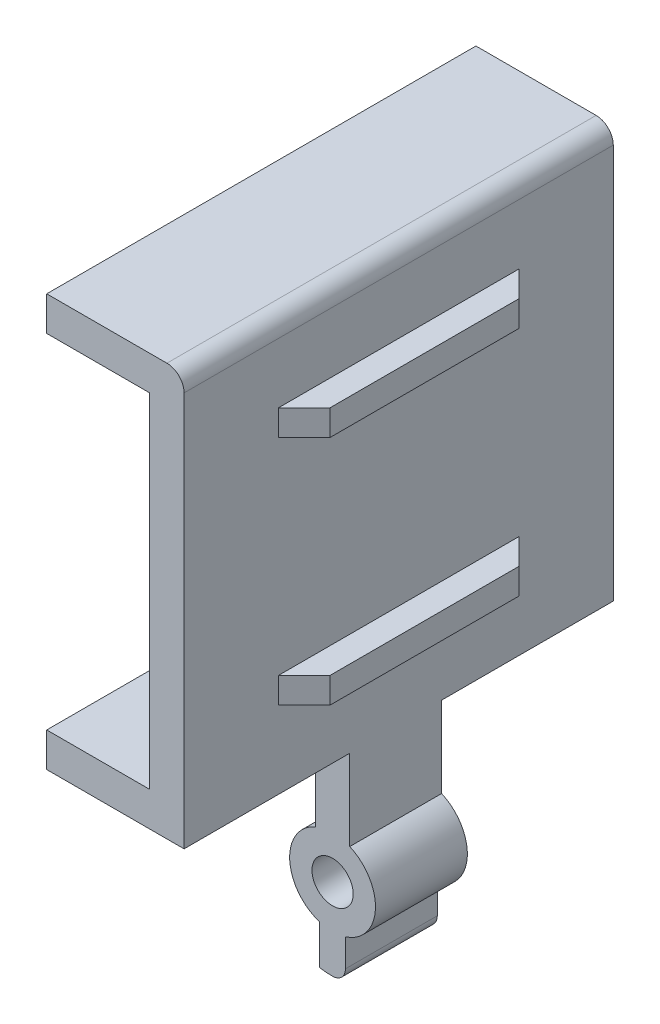
ISO-10303-21;
HEADER;
FILE_DESCRIPTION(('STEP AP214'),'2;1');
FILE_NAME('part.step','',(''),(''),'','','');
FILE_SCHEMA(('AUTOMOTIVE_DESIGN { 1 0 10303 214 1 1 1 1 }'));
ENDSEC;
DATA;
#1=APPLICATION_CONTEXT('core data for automotive mechanical design processes');
#2=APPLICATION_PROTOCOL_DEFINITION('international standard','automotive_design',2000,#1);
#3=PRODUCT_CONTEXT('',#1,'mechanical');
#4=PRODUCT('Part','Part','',(#3));
#5=PRODUCT_RELATED_PRODUCT_CATEGORY('part','',(#4));
#6=PRODUCT_DEFINITION_FORMATION('','',#4);
#7=PRODUCT_DEFINITION_CONTEXT('part definition',#1,'design');
#8=PRODUCT_DEFINITION('design','',#6,#7);
#9=PRODUCT_DEFINITION_SHAPE('','',#8);
#10=(LENGTH_UNIT() NAMED_UNIT(*) SI_UNIT(.MILLI.,.METRE.));
#11=(NAMED_UNIT(*) PLANE_ANGLE_UNIT() SI_UNIT($,.RADIAN.));
#12=(NAMED_UNIT(*) SI_UNIT($,.STERADIAN.) SOLID_ANGLE_UNIT());
#13=UNCERTAINTY_MEASURE_WITH_UNIT(LENGTH_MEASURE(1.E-05),#10,'distance_accuracy_value','');
#14=(GEOMETRIC_REPRESENTATION_CONTEXT(3) GLOBAL_UNCERTAINTY_ASSIGNED_CONTEXT((#13)) GLOBAL_UNIT_ASSIGNED_CONTEXT((#10,
#11,#12)) REPRESENTATION_CONTEXT('',''));
#15=CARTESIAN_POINT('',(0.,0.,0.));
#16=DIRECTION('',(0.,0.,1.));
#17=DIRECTION('',(1.,0.,0.));
#18=AXIS2_PLACEMENT_3D('',#15,#16,#17);
#19=CARTESIAN_POINT('',(2.5,11.5,-5.));
#20=DIRECTION('',(-1.,0.,0.));
#21=DIRECTION('',(0.,-1.,0.));
#22=AXIS2_PLACEMENT_3D('',#19,#20,#21);
#23=PLANE('',#22);
#24=DIRECTION('',(0.,0.,1.));
#25=VECTOR('',#24,1.);
#26=CARTESIAN_POINT('',(2.5,26.5,-5.));
#27=LINE('',#26,#25);
#28=CARTESIAN_POINT('',(2.5,26.5,-2.99999999999999));
#29=VERTEX_POINT('',#28);
#30=CARTESIAN_POINT('',(2.5,26.5,7.99999999999997));
#31=VERTEX_POINT('',#30);
#32=EDGE_CURVE('E297',#29,#31,#27,.T.);
#33=ORIENTED_EDGE('',*,*,#32,.T.);
#34=DIRECTION('',(0.,-1.,0.));
#35=VECTOR('',#34,1.);
#36=CARTESIAN_POINT('',(2.5,11.5,7.99999999999997));
#37=LINE('',#36,#35);
#38=CARTESIAN_POINT('',(2.5,25.,7.99999999999997));
#39=VERTEX_POINT('',#38);
#40=EDGE_CURVE('E386',#31,#39,#37,.T.);
#41=ORIENTED_EDGE('',*,*,#40,.T.);
#42=DIRECTION('',(0.,0.,-1.));
#43=VECTOR('',#42,1.);
#44=CARTESIAN_POINT('',(2.5,25.,10.));
#45=LINE('',#44,#43);
#46=CARTESIAN_POINT('',(2.5,25.,-2.99999999999999));
#47=VERTEX_POINT('',#46);
#48=EDGE_CURVE('E285',#39,#47,#45,.T.);
#49=ORIENTED_EDGE('',*,*,#48,.T.);
#50=DIRECTION('',(0.,1.,0.));
#51=VECTOR('',#50,1.);
#52=CARTESIAN_POINT('',(2.5,26.5,-2.99999999999999));
#53=LINE('',#52,#51);
#54=EDGE_CURVE('E383',#47,#29,#53,.T.);
#55=ORIENTED_EDGE('',*,*,#54,.T.);
#56=EDGE_LOOP('',(#33,#41,#49,#55));
#57=FACE_BOUND('',#56,.T.);
#58=ADVANCED_FACE('F36',(#57),#23,.F.);
#59=CARTESIAN_POINT('',(0.999999999999998,2.29128784747792,5.35));
#60=DIRECTION('',(-1.,0.,0.));
#61=DIRECTION('',(0.,-1.,0.));
#62=AXIS2_PLACEMENT_3D('',#59,#60,#61);
#63=PLANE('',#62);
#64=DIRECTION('',(0.,1.,0.));
#65=VECTOR('',#64,1.);
#66=CARTESIAN_POINT('',(0.999999999999998,2.29128784747792,0.));
#67=LINE('',#66,#65);
#68=CARTESIAN_POINT('',(0.999999999999998,2.29128784747792,0.));
#69=VERTEX_POINT('',#68);
#70=CARTESIAN_POINT('',(0.999999999999999,7.,0.));
#71=VERTEX_POINT('',#70);
#72=EDGE_CURVE('E214',#69,#71,#67,.T.);
#73=ORIENTED_EDGE('',*,*,#72,.T.);
#74=DIRECTION('',(0.,0.,-1.));
#75=VECTOR('',#74,1.);
#76=CARTESIAN_POINT('',(0.999999999999998,7.,15.));
#77=LINE('',#76,#75);
#78=CARTESIAN_POINT('',(0.999999999999998,7.,-10.));
#79=VERTEX_POINT('',#78);
#80=EDGE_CURVE('E206',#71,#79,#77,.T.);
#81=ORIENTED_EDGE('',*,*,#80,.T.);
#82=DIRECTION('',(0.,-1.,0.));
#83=VECTOR('',#82,1.);
#84=CARTESIAN_POINT('',(0.999999999999998,7.,-10.));
#85=LINE('',#84,#83);
#86=CARTESIAN_POINT('',(1.,30.,-10.));
#87=VERTEX_POINT('',#86);
#88=EDGE_CURVE('E211',#87,#79,#85,.T.);
#89=ORIENTED_EDGE('',*,*,#88,.F.);
#90=DIRECTION('',(0.,0.,-1.));
#91=VECTOR('',#90,1.);
#92=CARTESIAN_POINT('',(1.,30.,5.35));
#93=LINE('',#92,#91);
#94=CARTESIAN_POINT('',(1.,30.,15.));
#95=VERTEX_POINT('',#94);
#96=EDGE_CURVE('E358',#95,#87,#93,.T.);
#97=ORIENTED_EDGE('',*,*,#96,.F.);
#98=DIRECTION('',(0.,-1.,0.));
#99=VECTOR('',#98,1.);
#100=CARTESIAN_POINT('',(0.999999999999998,7.,15.));
#101=LINE('',#100,#99);
#102=CARTESIAN_POINT('',(0.999999999999998,7.,15.));
#103=VERTEX_POINT('',#102);
#104=EDGE_CURVE('E253',#95,#103,#101,.T.);
#105=ORIENTED_EDGE('',*,*,#104,.T.);
#106=CARTESIAN_POINT('',(0.999999999999999,7.,5.35));
#107=VERTEX_POINT('',#106);
#108=EDGE_CURVE('E217',#103,#107,#77,.T.);
#109=ORIENTED_EDGE('',*,*,#108,.T.);
#110=DIRECTION('',(0.,1.,0.));
#111=VECTOR('',#110,1.);
#112=CARTESIAN_POINT('',(0.999999999999998,2.29128784747792,5.35));
#113=LINE('',#112,#111);
#114=CARTESIAN_POINT('',(0.999999999999998,2.29128784747792,5.35));
#115=VERTEX_POINT('',#114);
#116=EDGE_CURVE('E337',#115,#107,#113,.T.);
#117=ORIENTED_EDGE('',*,*,#116,.F.);
#118=DIRECTION('',(0.,0.,-1.));
#119=VECTOR('',#118,1.);
#120=CARTESIAN_POINT('',(0.999999999999998,2.29128784747792,5.35));
#121=LINE('',#120,#119);
#122=EDGE_CURVE('E360',#115,#69,#121,.T.);
#123=ORIENTED_EDGE('',*,*,#122,.T.);
#124=EDGE_LOOP('',(#73,#81,#89,#97,#105,#109,#117,#123));
#125=FACE_BOUND('',#124,.T.);
#126=DIRECTION('',(0.,0.,-1.));
#127=VECTOR('',#126,1.);
#128=CARTESIAN_POINT('',(0.999999999999999,11.5,5.35));
#129=LINE('',#128,#127);
#130=CARTESIAN_POINT('',(0.999999999999999,11.5,9.49999999999998));
#131=VERTEX_POINT('',#130);
#132=CARTESIAN_POINT('',(0.999999999999999,11.5,-4.49999999999997));
#133=VERTEX_POINT('',#132);
#134=EDGE_CURVE('E377',#131,#133,#129,.T.);
#135=ORIENTED_EDGE('',*,*,#134,.F.);
#136=DIRECTION('',(0.,-1.,0.));
#137=VECTOR('',#136,1.);
#138=CARTESIAN_POINT('',(0.999999999999998,2.29128784747792,9.49999999999998));
#139=LINE('',#138,#137);
#140=CARTESIAN_POINT('',(0.999999999999999,13.,9.49999999999998));
#141=VERTEX_POINT('',#140);
#142=EDGE_CURVE('E413',#131,#141,#139,.F.);
#143=ORIENTED_EDGE('',*,*,#142,.T.);
#144=DIRECTION('',(0.,0.,-1.));
#145=VECTOR('',#144,1.);
#146=CARTESIAN_POINT('',(0.999999999999999,13.,10.));
#147=LINE('',#146,#145);
#148=CARTESIAN_POINT('',(0.999999999999999,13.,-4.49999999999997));
#149=VERTEX_POINT('',#148);
#150=EDGE_CURVE('E292',#141,#149,#147,.T.);
#151=ORIENTED_EDGE('',*,*,#150,.T.);
#152=DIRECTION('',(0.,-1.,0.));
#153=VECTOR('',#152,1.);
#154=CARTESIAN_POINT('',(0.999999999999998,2.29128784747792,-4.49999999999997));
#155=LINE('',#154,#153);
#156=EDGE_CURVE('E46',#149,#133,#155,.T.);
#157=ORIENTED_EDGE('',*,*,#156,.T.);
#158=EDGE_LOOP('',(#135,#143,#151,#157));
#159=FACE_BOUND('',#158,.T.);
#160=DIRECTION('',(0.,0.,1.));
#161=VECTOR('',#160,1.);
#162=CARTESIAN_POINT('',(1.,26.5,5.35));
#163=LINE('',#162,#161);
#164=CARTESIAN_POINT('',(1.,26.5,-4.49999999999997));
#165=VERTEX_POINT('',#164);
#166=CARTESIAN_POINT('',(1.,26.5,9.49999999999998));
#167=VERTEX_POINT('',#166);
#168=EDGE_CURVE('E380',#165,#167,#163,.T.);
#169=ORIENTED_EDGE('',*,*,#168,.F.);
#170=DIRECTION('',(0.,-1.,0.));
#171=VECTOR('',#170,1.);
#172=CARTESIAN_POINT('',(0.999999999999998,2.29128784747792,-4.49999999999997));
#173=LINE('',#172,#171);
#174=CARTESIAN_POINT('',(1.,25.,-4.49999999999997));
#175=VERTEX_POINT('',#174);
#176=EDGE_CURVE('E11',#165,#175,#173,.T.);
#177=ORIENTED_EDGE('',*,*,#176,.T.);
#178=DIRECTION('',(0.,0.,-1.));
#179=VECTOR('',#178,1.);
#180=CARTESIAN_POINT('',(1.,25.,10.));
#181=LINE('',#180,#179);
#182=CARTESIAN_POINT('',(1.,25.,9.49999999999998));
#183=VERTEX_POINT('',#182);
#184=EDGE_CURVE('E289',#183,#175,#181,.T.);
#185=ORIENTED_EDGE('',*,*,#184,.F.);
#186=DIRECTION('',(0.,-1.,0.));
#187=VECTOR('',#186,1.);
#188=CARTESIAN_POINT('',(0.999999999999998,2.29128784747792,9.49999999999998));
#189=LINE('',#188,#187);
#190=EDGE_CURVE('E411',#183,#167,#189,.F.);
#191=ORIENTED_EDGE('',*,*,#190,.T.);
#192=EDGE_LOOP('',(#169,#177,#185,#191));
#193=FACE_BOUND('',#192,.T.);
#194=ADVANCED_FACE('F208',(#125,#159,#193),#63,.F.);
#195=CARTESIAN_POINT('',(-1.,2.29128784747792,5.35));
#196=DIRECTION('',(1.,0.,0.));
#197=DIRECTION('',(0.,1.,0.));
#198=AXIS2_PLACEMENT_3D('',#195,#196,#197);
#199=PLANE('',#198);
#200=DIRECTION('',(0.,0.,-1.));
#201=VECTOR('',#200,1.);
#202=CARTESIAN_POINT('',(-1.,9.,5.35));
#203=LINE('',#202,#201);
#204=CARTESIAN_POINT('',(-1.,9.,15.));
#205=VERTEX_POINT('',#204);
#206=CARTESIAN_POINT('',(-1.,9.,-10.));
#207=VERTEX_POINT('',#206);
#208=EDGE_CURVE('E306',#205,#207,#203,.T.);
#209=ORIENTED_EDGE('',*,*,#208,.F.);
#210=DIRECTION('',(0.,1.,0.));
#211=VECTOR('',#210,1.);
#212=CARTESIAN_POINT('',(-1.,29.,15.));
#213=LINE('',#212,#211);
#214=CARTESIAN_POINT('',(-1.,29.,15.));
#215=VERTEX_POINT('',#214);
#216=EDGE_CURVE('E264',#205,#215,#213,.T.);
#217=ORIENTED_EDGE('',*,*,#216,.T.);
#218=DIRECTION('',(0.,0.,-1.));
#219=VECTOR('',#218,1.);
#220=CARTESIAN_POINT('',(-1.,29.,12.6301098892805));
#221=LINE('',#220,#219);
#222=CARTESIAN_POINT('',(-1.,29.,-10.));
#223=VERTEX_POINT('',#222);
#224=EDGE_CURVE('E308',#215,#223,#221,.T.);
#225=ORIENTED_EDGE('',*,*,#224,.T.);
#226=DIRECTION('',(0.,1.,0.));
#227=VECTOR('',#226,1.);
#228=CARTESIAN_POINT('',(-1.,29.,-10.));
#229=LINE('',#228,#227);
#230=EDGE_CURVE('E241',#207,#223,#229,.T.);
#231=ORIENTED_EDGE('',*,*,#230,.F.);
#232=EDGE_LOOP('',(#209,#217,#225,#231));
#233=FACE_BOUND('',#232,.T.);
#234=ADVANCED_FACE('F449',(#233),#199,.F.);
#235=CARTESIAN_POINT('',(0.,30.,5.35));
#236=DIRECTION('',(0.,0.,-1.));
#237=DIRECTION('',(-1.,0.,0.));
#238=AXIS2_PLACEMENT_3D('',#235,#236,#237);
#239=CYLINDRICAL_SURFACE('',#238,1.);
#240=DIRECTION('',(0.,0.,-1.));
#241=VECTOR('',#240,1.);
#242=CARTESIAN_POINT('',(0.,31.,12.6301098892805));
#243=LINE('',#242,#241);
#244=CARTESIAN_POINT('',(0.,31.,15.));
#245=VERTEX_POINT('',#244);
#246=CARTESIAN_POINT('',(0.,31.,-10.));
#247=VERTEX_POINT('',#246);
#248=EDGE_CURVE('E309',#245,#247,#243,.T.);
#249=ORIENTED_EDGE('',*,*,#248,.F.);
#250=CARTESIAN_POINT('',(0.,30.,15.));
#251=DIRECTION('',(0.,0.,-1.));
#252=DIRECTION('',(-1.,0.,0.));
#253=AXIS2_PLACEMENT_3D('',#250,#251,#252);
#254=CIRCLE('',#253,1.);
#255=EDGE_CURVE('E218',#245,#95,#254,.T.);
#256=ORIENTED_EDGE('',*,*,#255,.T.);
#257=ORIENTED_EDGE('',*,*,#96,.T.);
#258=CARTESIAN_POINT('',(0.,30.,-10.));
#259=DIRECTION('',(0.,0.,-1.));
#260=DIRECTION('',(-1.,0.,0.));
#261=AXIS2_PLACEMENT_3D('',#258,#259,#260);
#262=CIRCLE('',#261,1.);
#263=EDGE_CURVE('E234',#247,#87,#262,.T.);
#264=ORIENTED_EDGE('',*,*,#263,.F.);
#265=EDGE_LOOP('',(#249,#256,#257,#264));
#266=FACE_BOUND('',#265,.T.);
#267=ADVANCED_FACE('F495',(#266),#239,.T.);
#268=CARTESIAN_POINT('',(0.,0.,5.35));
#269=DIRECTION('',(0.,0.,1.));
#270=DIRECTION('',(1.,0.,0.));
#271=AXIS2_PLACEMENT_3D('',#268,#269,#270);
#272=PLANE('',#271);
#273=DIRECTION('',(1.,0.,0.));
#274=VECTOR('',#273,1.);
#275=CARTESIAN_POINT('',(0.,7.,5.35));
#276=LINE('',#275,#274);
#277=CARTESIAN_POINT('',(-1.,7.,5.35));
#278=VERTEX_POINT('',#277);
#279=EDGE_CURVE('E281',#278,#107,#276,.T.);
#280=ORIENTED_EDGE('',*,*,#279,.F.);
#281=DIRECTION('',(0.,-1.,0.));
#282=VECTOR('',#281,1.);
#283=CARTESIAN_POINT('',(-1.,2.29128784747792,5.35));
#284=LINE('',#283,#282);
#285=CARTESIAN_POINT('',(-1.,2.29128784747792,5.35));
#286=VERTEX_POINT('',#285);
#287=EDGE_CURVE('E339',#278,#286,#284,.T.);
#288=ORIENTED_EDGE('',*,*,#287,.T.);
#289=CARTESIAN_POINT('',(0.,0.,5.35));
#290=DIRECTION('',(0.,0.,1.));
#291=DIRECTION('',(1.,0.,0.));
#292=AXIS2_PLACEMENT_3D('',#289,#290,#291);
#293=CIRCLE('',#292,2.5);
#294=CARTESIAN_POINT('',(-0.750000000000004,-2.38484800354236,5.35));
#295=VERTEX_POINT('',#294);
#296=EDGE_CURVE('E323',#286,#295,#293,.T.);
#297=ORIENTED_EDGE('',*,*,#296,.T.);
#298=DIRECTION('',(0.,-1.,0.));
#299=VECTOR('',#298,1.);
#300=CARTESIAN_POINT('',(-0.750000000000001,-4.69041575982343,5.35));
#301=LINE('',#300,#299);
#302=CARTESIAN_POINT('',(-0.750000000000002,-4.69041575982343,5.35));
#303=VERTEX_POINT('',#302);
#304=EDGE_CURVE('E326',#295,#303,#301,.T.);
#305=ORIENTED_EDGE('',*,*,#304,.T.);
#306=CARTESIAN_POINT('',(0.,0.,5.35));
#307=DIRECTION('',(0.,0.,1.));
#308=DIRECTION('',(1.,0.,0.));
#309=AXIS2_PLACEMENT_3D('',#306,#307,#308);
#310=CIRCLE('',#309,4.75);
#311=CARTESIAN_POINT('',(0.,-4.75,5.35));
#312=VERTEX_POINT('',#311);
#313=EDGE_CURVE('E329',#303,#312,#310,.T.);
#314=ORIENTED_EDGE('',*,*,#313,.T.);
#315=CARTESIAN_POINT('',(0.,-4.,5.35));
#316=DIRECTION('',(0.,0.,1.));
#317=DIRECTION('',(1.,0.,0.));
#318=AXIS2_PLACEMENT_3D('',#315,#316,#317);
#319=CIRCLE('',#318,0.750000000000001);
#320=CARTESIAN_POINT('',(0.750000000000001,-4.,5.35));
#321=VERTEX_POINT('',#320);
#322=EDGE_CURVE('E331',#312,#321,#319,.T.);
#323=ORIENTED_EDGE('',*,*,#322,.T.);
#324=DIRECTION('',(0.,1.,0.));
#325=VECTOR('',#324,1.);
#326=CARTESIAN_POINT('',(0.750000000000001,-4.,5.35));
#327=LINE('',#326,#325);
#328=CARTESIAN_POINT('',(0.749999999999997,-2.38484800354236,5.35));
#329=VERTEX_POINT('',#328);
#330=EDGE_CURVE('E333',#321,#329,#327,.T.);
#331=ORIENTED_EDGE('',*,*,#330,.T.);
#332=CARTESIAN_POINT('',(0.,0.,5.35));
#333=DIRECTION('',(0.,0.,1.));
#334=DIRECTION('',(1.,0.,0.));
#335=AXIS2_PLACEMENT_3D('',#332,#333,#334);
#336=CIRCLE('',#335,2.5);
#337=EDGE_CURVE('E335',#329,#115,#336,.T.);
#338=ORIENTED_EDGE('',*,*,#337,.T.);
#339=ORIENTED_EDGE('',*,*,#116,.T.);
#340=EDGE_LOOP('',(#280,#288,#297,#305,#314,#323,#331,#338,#339));
#341=FACE_BOUND('',#340,.T.);
#342=CARTESIAN_POINT('',(0.,0.,5.35));
#343=DIRECTION('',(0.,0.,1.));
#344=DIRECTION('',(1.,0.,0.));
#345=AXIS2_PLACEMENT_3D('',#342,#343,#344);
#346=CIRCLE('',#345,1.2);
#347=CARTESIAN_POINT('',(1.2,0.,5.35));
#348=VERTEX_POINT('',#347);
#349=EDGE_CURVE('E311',#348,#348,#346,.T.);
#350=ORIENTED_EDGE('',*,*,#349,.F.);
#351=EDGE_LOOP('',(#350));
#352=FACE_BOUND('',#351,.T.);
#353=ADVANCED_FACE('F491',(#341,#352),#272,.T.);
#354=CARTESIAN_POINT('',(0.,0.,0.));
#355=DIRECTION('',(0.,0.,1.));
#356=DIRECTION('',(1.,0.,0.));
#357=AXIS2_PLACEMENT_3D('',#354,#355,#356);
#358=PLANE('',#357);
#359=CARTESIAN_POINT('',(0.,0.,0.));
#360=DIRECTION('',(0.,0.,1.));
#361=DIRECTION('',(1.,0.,0.));
#362=AXIS2_PLACEMENT_3D('',#359,#360,#361);
#363=CIRCLE('',#362,1.2);
#364=CARTESIAN_POINT('',(1.2,0.,0.));
#365=VERTEX_POINT('',#364);
#366=EDGE_CURVE('E317',#365,#365,#363,.T.);
#367=ORIENTED_EDGE('',*,*,#366,.T.);
#368=EDGE_LOOP('',(#367));
#369=FACE_BOUND('',#368,.T.);
#370=DIRECTION('',(0.,-1.,0.));
#371=VECTOR('',#370,1.);
#372=CARTESIAN_POINT('',(-1.,2.29128784747792,0.));
#373=LINE('',#372,#371);
#374=CARTESIAN_POINT('',(-1.,7.,0.));
#375=VERTEX_POINT('',#374);
#376=CARTESIAN_POINT('',(-1.,2.29128784747792,0.));
#377=VERTEX_POINT('',#376);
#378=EDGE_CURVE('E327',#375,#377,#373,.T.);
#379=ORIENTED_EDGE('',*,*,#378,.F.);
#380=DIRECTION('',(1.,0.,0.));
#381=VECTOR('',#380,1.);
#382=CARTESIAN_POINT('',(0.,7.,0.));
#383=LINE('',#382,#381);
#384=EDGE_CURVE('E279',#375,#71,#383,.T.);
#385=ORIENTED_EDGE('',*,*,#384,.T.);
#386=ORIENTED_EDGE('',*,*,#72,.F.);
#387=CARTESIAN_POINT('',(0.,0.,0.));
#388=DIRECTION('',(0.,0.,1.));
#389=DIRECTION('',(1.,0.,0.));
#390=AXIS2_PLACEMENT_3D('',#387,#388,#389);
#391=CIRCLE('',#390,2.5);
#392=CARTESIAN_POINT('',(0.749999999999997,-2.38484800354236,0.));
#393=VERTEX_POINT('',#392);
#394=EDGE_CURVE('E352',#393,#69,#391,.T.);
#395=ORIENTED_EDGE('',*,*,#394,.F.);
#396=DIRECTION('',(0.,1.,0.));
#397=VECTOR('',#396,1.);
#398=CARTESIAN_POINT('',(0.750000000000001,-4.,0.));
#399=LINE('',#398,#397);
#400=CARTESIAN_POINT('',(0.750000000000001,-4.,0.));
#401=VERTEX_POINT('',#400);
#402=EDGE_CURVE('E350',#401,#393,#399,.T.);
#403=ORIENTED_EDGE('',*,*,#402,.F.);
#404=CARTESIAN_POINT('',(0.,-4.,0.));
#405=DIRECTION('',(0.,0.,1.));
#406=DIRECTION('',(1.,0.,0.));
#407=AXIS2_PLACEMENT_3D('',#404,#405,#406);
#408=CIRCLE('',#407,0.750000000000001);
#409=CARTESIAN_POINT('',(0.,-4.75,0.));
#410=VERTEX_POINT('',#409);
#411=EDGE_CURVE('E348',#410,#401,#408,.T.);
#412=ORIENTED_EDGE('',*,*,#411,.F.);
#413=CARTESIAN_POINT('',(0.,0.,0.));
#414=DIRECTION('',(0.,0.,1.));
#415=DIRECTION('',(1.,0.,0.));
#416=AXIS2_PLACEMENT_3D('',#413,#414,#415);
#417=CIRCLE('',#416,4.75);
#418=CARTESIAN_POINT('',(-0.750000000000002,-4.69041575982343,0.));
#419=VERTEX_POINT('',#418);
#420=EDGE_CURVE('E346',#419,#410,#417,.T.);
#421=ORIENTED_EDGE('',*,*,#420,.F.);
#422=DIRECTION('',(0.,-1.,0.));
#423=VECTOR('',#422,1.);
#424=CARTESIAN_POINT('',(-0.750000000000001,-4.69041575982343,0.));
#425=LINE('',#424,#423);
#426=CARTESIAN_POINT('',(-0.750000000000004,-2.38484800354236,0.));
#427=VERTEX_POINT('',#426);
#428=EDGE_CURVE('E344',#427,#419,#425,.T.);
#429=ORIENTED_EDGE('',*,*,#428,.F.);
#430=CARTESIAN_POINT('',(0.,0.,0.));
#431=DIRECTION('',(0.,0.,1.));
#432=DIRECTION('',(1.,0.,0.));
#433=AXIS2_PLACEMENT_3D('',#430,#431,#432);
#434=CIRCLE('',#433,2.5);
#435=EDGE_CURVE('E320',#377,#427,#434,.T.);
#436=ORIENTED_EDGE('',*,*,#435,.F.);
#437=EDGE_LOOP('',(#379,#385,#386,#395,#403,#412,#421,#429,#436));
#438=FACE_BOUND('',#437,.T.);
#439=ADVANCED_FACE('F494',(#369,#438),#358,.F.);
#440=CARTESIAN_POINT('',(0.,0.,5.35));
#441=DIRECTION('',(0.,0.,-1.));
#442=DIRECTION('',(-1.,0.,0.));
#443=AXIS2_PLACEMENT_3D('',#440,#441,#442);
#444=CYLINDRICAL_SURFACE('',#443,2.5);
#445=ORIENTED_EDGE('',*,*,#435,.T.);
#446=DIRECTION('',(0.,0.,-1.));
#447=VECTOR('',#446,1.);
#448=CARTESIAN_POINT('',(-0.750000000000004,-2.38484800354236,5.35));
#449=LINE('',#448,#447);
#450=EDGE_CURVE('E374',#295,#427,#449,.T.);
#451=ORIENTED_EDGE('',*,*,#450,.F.);
#452=ORIENTED_EDGE('',*,*,#296,.F.);
#453=DIRECTION('',(0.,0.,-1.));
#454=VECTOR('',#453,1.);
#455=CARTESIAN_POINT('',(-1.,2.29128784747792,5.35));
#456=LINE('',#455,#454);
#457=EDGE_CURVE('E341',#286,#377,#456,.T.);
#458=ORIENTED_EDGE('',*,*,#457,.T.);
#459=EDGE_LOOP('',(#445,#451,#452,#458));
#460=FACE_BOUND('',#459,.T.);
#461=ADVANCED_FACE('F499',(#460),#444,.T.);
#462=CARTESIAN_POINT('',(-0.750000000000001,-4.69041575982343,5.35));
#463=DIRECTION('',(1.,0.,0.));
#464=DIRECTION('',(0.,1.,0.));
#465=AXIS2_PLACEMENT_3D('',#462,#463,#464);
#466=PLANE('',#465);
#467=ORIENTED_EDGE('',*,*,#428,.T.);
#468=DIRECTION('',(0.,0.,-1.));
#469=VECTOR('',#468,1.);
#470=CARTESIAN_POINT('',(-0.750000000000002,-4.69041575982343,5.35));
#471=LINE('',#470,#469);
#472=EDGE_CURVE('E371',#303,#419,#471,.T.);
#473=ORIENTED_EDGE('',*,*,#472,.F.);
#474=ORIENTED_EDGE('',*,*,#304,.F.);
#475=ORIENTED_EDGE('',*,*,#450,.T.);
#476=EDGE_LOOP('',(#467,#473,#474,#475));
#477=FACE_BOUND('',#476,.T.);
#478=ADVANCED_FACE('F522',(#477),#466,.F.);
#479=CARTESIAN_POINT('',(0.,0.,5.35));
#480=DIRECTION('',(0.,0.,-1.));
#481=DIRECTION('',(-1.,0.,0.));
#482=AXIS2_PLACEMENT_3D('',#479,#480,#481);
#483=CYLINDRICAL_SURFACE('',#482,4.75);
#484=ORIENTED_EDGE('',*,*,#420,.T.);
#485=DIRECTION('',(0.,0.,-1.));
#486=VECTOR('',#485,1.);
#487=CARTESIAN_POINT('',(0.,-4.75,5.35));
#488=LINE('',#487,#486);
#489=EDGE_CURVE('E368',#312,#410,#488,.T.);
#490=ORIENTED_EDGE('',*,*,#489,.F.);
#491=ORIENTED_EDGE('',*,*,#313,.F.);
#492=ORIENTED_EDGE('',*,*,#472,.T.);
#493=EDGE_LOOP('',(#484,#490,#491,#492));
#494=FACE_BOUND('',#493,.T.);
#495=ADVANCED_FACE('F518',(#494),#483,.T.);
#496=CARTESIAN_POINT('',(0.,-4.,5.35));
#497=DIRECTION('',(0.,0.,-1.));
#498=DIRECTION('',(-1.,0.,0.));
#499=AXIS2_PLACEMENT_3D('',#496,#497,#498);
#500=CYLINDRICAL_SURFACE('',#499,0.750000000000001);
#501=ORIENTED_EDGE('',*,*,#411,.T.);
#502=DIRECTION('',(0.,0.,-1.));
#503=VECTOR('',#502,1.);
#504=CARTESIAN_POINT('',(0.750000000000001,-4.,5.35));
#505=LINE('',#504,#503);
#506=EDGE_CURVE('E365',#321,#401,#505,.T.);
#507=ORIENTED_EDGE('',*,*,#506,.F.);
#508=ORIENTED_EDGE('',*,*,#322,.F.);
#509=ORIENTED_EDGE('',*,*,#489,.T.);
#510=EDGE_LOOP('',(#501,#507,#508,#509));
#511=FACE_BOUND('',#510,.T.);
#512=ADVANCED_FACE('F514',(#511),#500,.T.);
#513=CARTESIAN_POINT('',(0.750000000000001,-4.,5.35));
#514=DIRECTION('',(-1.,0.,0.));
#515=DIRECTION('',(0.,-1.,0.));
#516=AXIS2_PLACEMENT_3D('',#513,#514,#515);
#517=PLANE('',#516);
#518=ORIENTED_EDGE('',*,*,#402,.T.);
#519=DIRECTION('',(0.,0.,-1.));
#520=VECTOR('',#519,1.);
#521=CARTESIAN_POINT('',(0.749999999999997,-2.38484800354236,5.35));
#522=LINE('',#521,#520);
#523=EDGE_CURVE('E362',#329,#393,#522,.T.);
#524=ORIENTED_EDGE('',*,*,#523,.F.);
#525=ORIENTED_EDGE('',*,*,#330,.F.);
#526=ORIENTED_EDGE('',*,*,#506,.T.);
#527=EDGE_LOOP('',(#518,#524,#525,#526));
#528=FACE_BOUND('',#527,.T.);
#529=ADVANCED_FACE('F510',(#528),#517,.F.);
#530=CARTESIAN_POINT('',(0.,0.,5.35));
#531=DIRECTION('',(0.,0.,-1.));
#532=DIRECTION('',(-1.,0.,0.));
#533=AXIS2_PLACEMENT_3D('',#530,#531,#532);
#534=CYLINDRICAL_SURFACE('',#533,2.5);
#535=ORIENTED_EDGE('',*,*,#394,.T.);
#536=ORIENTED_EDGE('',*,*,#122,.F.);
#537=ORIENTED_EDGE('',*,*,#337,.F.);
#538=ORIENTED_EDGE('',*,*,#523,.T.);
#539=EDGE_LOOP('',(#535,#536,#537,#538));
#540=FACE_BOUND('',#539,.T.);
#541=ADVANCED_FACE('F503',(#540),#534,.T.);
#542=ORIENTED_EDGE('',*,*,#287,.F.);
#543=DIRECTION('',(0.,0.,-1.));
#544=VECTOR('',#543,1.);
#545=CARTESIAN_POINT('',(-1.,7.,5.35));
#546=LINE('',#545,#544);
#547=EDGE_CURVE('E300',#278,#375,#546,.T.);
#548=ORIENTED_EDGE('',*,*,#547,.T.);
#549=ORIENTED_EDGE('',*,*,#378,.T.);
#550=ORIENTED_EDGE('',*,*,#457,.F.);
#551=EDGE_LOOP('',(#542,#548,#549,#550));
#552=FACE_BOUND('',#551,.T.);
#553=ADVANCED_FACE('F489',(#552),#199,.F.);
#554=CARTESIAN_POINT('',(0.,0.,0.));
#555=DIRECTION('',(0.,0.,1.));
#556=DIRECTION('',(1.,0.,0.));
#557=AXIS2_PLACEMENT_3D('',#554,#555,#556);
#558=CYLINDRICAL_SURFACE('',#557,1.2);
#559=ORIENTED_EDGE('',*,*,#366,.F.);
#560=EDGE_LOOP('',(#559));
#561=FACE_BOUND('',#560,.T.);
#562=ORIENTED_EDGE('',*,*,#349,.T.);
#563=EDGE_LOOP('',(#562));
#564=FACE_BOUND('',#563,.T.);
#565=ADVANCED_FACE('F485',(#561,#564),#558,.F.);
#566=CARTESIAN_POINT('',(-7.,29.,12.6301098892805));
#567=DIRECTION('',(0.,-1.,0.));
#568=DIRECTION('',(0.,0.,-1.));
#569=AXIS2_PLACEMENT_3D('',#566,#567,#568);
#570=PLANE('',#569);
#571=ORIENTED_EDGE('',*,*,#224,.F.);
#572=DIRECTION('',(-1.,0.,0.));
#573=VECTOR('',#572,1.);
#574=CARTESIAN_POINT('',(-1.,29.,15.));
#575=LINE('',#574,#573);
#576=CARTESIAN_POINT('',(-7.,29.,15.));
#577=VERTEX_POINT('',#576);
#578=EDGE_CURVE('E267',#215,#577,#575,.T.);
#579=ORIENTED_EDGE('',*,*,#578,.T.);
#580=DIRECTION('',(0.,0.,-1.));
#581=VECTOR('',#580,1.);
#582=CARTESIAN_POINT('',(-7.,29.,12.6301098892805));
#583=LINE('',#582,#581);
#584=CARTESIAN_POINT('',(-7.,29.,-10.));
#585=VERTEX_POINT('',#584);
#586=EDGE_CURVE('E314',#577,#585,#583,.T.);
#587=ORIENTED_EDGE('',*,*,#586,.T.);
#588=DIRECTION('',(-1.,0.,0.));
#589=VECTOR('',#588,1.);
#590=CARTESIAN_POINT('',(-1.,29.,-10.));
#591=LINE('',#590,#589);
#592=EDGE_CURVE('E244',#223,#585,#591,.T.);
#593=ORIENTED_EDGE('',*,*,#592,.F.);
#594=EDGE_LOOP('',(#571,#579,#587,#593));
#595=FACE_BOUND('',#594,.T.);
#596=ADVANCED_FACE('F481',(#595),#570,.T.);
#597=CARTESIAN_POINT('',(-7.,31.,12.6301098892805));
#598=DIRECTION('',(-1.,0.,0.));
#599=DIRECTION('',(0.,0.,1.));
#600=AXIS2_PLACEMENT_3D('',#597,#598,#599);
#601=PLANE('',#600);
#602=ORIENTED_EDGE('',*,*,#586,.F.);
#603=DIRECTION('',(0.,1.,0.));
#604=VECTOR('',#603,1.);
#605=CARTESIAN_POINT('',(-7.,29.,15.));
#606=LINE('',#605,#604);
#607=CARTESIAN_POINT('',(-7.,31.,15.));
#608=VERTEX_POINT('',#607);
#609=EDGE_CURVE('E270',#577,#608,#606,.T.);
#610=ORIENTED_EDGE('',*,*,#609,.T.);
#611=DIRECTION('',(0.,0.,-1.));
#612=VECTOR('',#611,1.);
#613=CARTESIAN_POINT('',(-7.,31.,12.6301098892805));
#614=LINE('',#613,#612);
#615=CARTESIAN_POINT('',(-7.,31.,-10.));
#616=VERTEX_POINT('',#615);
#617=EDGE_CURVE('E312',#608,#616,#614,.T.);
#618=ORIENTED_EDGE('',*,*,#617,.T.);
#619=DIRECTION('',(0.,1.,0.));
#620=VECTOR('',#619,1.);
#621=CARTESIAN_POINT('',(-7.,29.,-10.));
#622=LINE('',#621,#620);
#623=EDGE_CURVE('E247',#585,#616,#622,.T.);
#624=ORIENTED_EDGE('',*,*,#623,.F.);
#625=EDGE_LOOP('',(#602,#610,#618,#624));
#626=FACE_BOUND('',#625,.T.);
#627=ADVANCED_FACE('F477',(#626),#601,.T.);
#628=CARTESIAN_POINT('',(0.,31.,12.6301098892805));
#629=DIRECTION('',(0.,1.,0.));
#630=DIRECTION('',(0.,0.,1.));
#631=AXIS2_PLACEMENT_3D('',#628,#629,#630);
#632=PLANE('',#631);
#633=ORIENTED_EDGE('',*,*,#617,.F.);
#634=DIRECTION('',(1.,0.,0.));
#635=VECTOR('',#634,1.);
#636=CARTESIAN_POINT('',(-7.,31.,15.));
#637=LINE('',#636,#635);
#638=EDGE_CURVE('E273',#608,#245,#637,.T.);
#639=ORIENTED_EDGE('',*,*,#638,.T.);
#640=ORIENTED_EDGE('',*,*,#248,.T.);
#641=DIRECTION('',(1.,0.,0.));
#642=VECTOR('',#641,1.);
#643=CARTESIAN_POINT('',(-7.,31.,-10.));
#644=LINE('',#643,#642);
#645=EDGE_CURVE('E250',#616,#247,#644,.T.);
#646=ORIENTED_EDGE('',*,*,#645,.F.);
#647=EDGE_LOOP('',(#633,#639,#640,#646));
#648=FACE_BOUND('',#647,.T.);
#649=ADVANCED_FACE('F473',(#648),#632,.T.);
#650=CARTESIAN_POINT('',(-1.,9.,5.35));
#651=DIRECTION('',(0.,-1.,0.));
#652=DIRECTION('',(0.,0.,-1.));
#653=AXIS2_PLACEMENT_3D('',#650,#651,#652);
#654=PLANE('',#653);
#655=ORIENTED_EDGE('',*,*,#208,.T.);
#656=DIRECTION('',(1.,0.,0.));
#657=VECTOR('',#656,1.);
#658=CARTESIAN_POINT('',(-1.,9.,-10.));
#659=LINE('',#658,#657);
#660=CARTESIAN_POINT('',(-7.,9.,-10.));
#661=VERTEX_POINT('',#660);
#662=EDGE_CURVE('E238',#661,#207,#659,.T.);
#663=ORIENTED_EDGE('',*,*,#662,.F.);
#664=DIRECTION('',(0.,0.,-1.));
#665=VECTOR('',#664,1.);
#666=CARTESIAN_POINT('',(-7.,9.,5.35));
#667=LINE('',#666,#665);
#668=CARTESIAN_POINT('',(-7.,9.,15.));
#669=VERTEX_POINT('',#668);
#670=EDGE_CURVE('E304',#669,#661,#667,.T.);
#671=ORIENTED_EDGE('',*,*,#670,.F.);
#672=DIRECTION('',(1.,0.,0.));
#673=VECTOR('',#672,1.);
#674=CARTESIAN_POINT('',(-1.,9.,15.));
#675=LINE('',#674,#673);
#676=EDGE_CURVE('E261',#669,#205,#675,.T.);
#677=ORIENTED_EDGE('',*,*,#676,.T.);
#678=EDGE_LOOP('',(#655,#663,#671,#677));
#679=FACE_BOUND('',#678,.T.);
#680=ADVANCED_FACE('F469',(#679),#654,.F.);
#681=CARTESIAN_POINT('',(-7.,7.,5.35));
#682=DIRECTION('',(-1.,0.,0.));
#683=DIRECTION('',(0.,0.,1.));
#684=AXIS2_PLACEMENT_3D('',#681,#682,#683);
#685=PLANE('',#684);
#686=ORIENTED_EDGE('',*,*,#670,.T.);
#687=DIRECTION('',(0.,1.,0.));
#688=VECTOR('',#687,1.);
#689=CARTESIAN_POINT('',(-7.,7.,-10.));
#690=LINE('',#689,#688);
#691=CARTESIAN_POINT('',(-7.,7.,-10.));
#692=VERTEX_POINT('',#691);
#693=EDGE_CURVE('E228',#692,#661,#690,.T.);
#694=ORIENTED_EDGE('',*,*,#693,.F.);
#695=DIRECTION('',(0.,0.,-1.));
#696=VECTOR('',#695,1.);
#697=CARTESIAN_POINT('',(-7.,7.,5.35));
#698=LINE('',#697,#696);
#699=CARTESIAN_POINT('',(-7.,7.,15.));
#700=VERTEX_POINT('',#699);
#701=EDGE_CURVE('E224',#700,#692,#698,.T.);
#702=ORIENTED_EDGE('',*,*,#701,.F.);
#703=DIRECTION('',(0.,1.,0.));
#704=VECTOR('',#703,1.);
#705=CARTESIAN_POINT('',(-7.,7.,15.));
#706=LINE('',#705,#704);
#707=EDGE_CURVE('E258',#700,#669,#706,.T.);
#708=ORIENTED_EDGE('',*,*,#707,.T.);
#709=EDGE_LOOP('',(#686,#694,#702,#708));
#710=FACE_BOUND('',#709,.T.);
#711=ADVANCED_FACE('F464',(#710),#685,.T.);
#712=CARTESIAN_POINT('',(-1.,7.,5.35));
#713=DIRECTION('',(0.,-1.,0.));
#714=DIRECTION('',(0.,0.,-1.));
#715=AXIS2_PLACEMENT_3D('',#712,#713,#714);
#716=PLANE('',#715);
#717=ORIENTED_EDGE('',*,*,#701,.T.);
#718=DIRECTION('',(-1.,0.,0.));
#719=VECTOR('',#718,1.);
#720=CARTESIAN_POINT('',(0.999999999999998,7.,-10.));
#721=LINE('',#720,#719);
#722=EDGE_CURVE('E221',#79,#692,#721,.T.);
#723=ORIENTED_EDGE('',*,*,#722,.F.);
#724=ORIENTED_EDGE('',*,*,#80,.F.);
#725=ORIENTED_EDGE('',*,*,#384,.F.);
#726=ORIENTED_EDGE('',*,*,#547,.F.);
#727=ORIENTED_EDGE('',*,*,#279,.T.);
#728=ORIENTED_EDGE('',*,*,#108,.F.);
#729=DIRECTION('',(-1.,0.,0.));
#730=VECTOR('',#729,1.);
#731=CARTESIAN_POINT('',(0.999999999999998,7.,15.));
#732=LINE('',#731,#730);
#733=EDGE_CURVE('E256',#103,#700,#732,.T.);
#734=ORIENTED_EDGE('',*,*,#733,.T.);
#735=EDGE_LOOP('',(#717,#723,#724,#725,#726,#727,#728,#734));
#736=FACE_BOUND('',#735,.T.);
#737=ADVANCED_FACE('F222',(#736),#716,.T.);
#738=CARTESIAN_POINT('',(0.999999999999998,26.5,-5.));
#739=DIRECTION('',(0.,-1.,0.));
#740=DIRECTION('',(0.,0.,-1.));
#741=AXIS2_PLACEMENT_3D('',#738,#739,#740);
#742=PLANE('',#741);
#743=ORIENTED_EDGE('',*,*,#168,.T.);
#744=DIRECTION('',(-0.707106781186544,0.,0.707106781186551));
#745=VECTOR('',#744,1.);
#746=CARTESIAN_POINT('',(2.5,26.5,7.99999999999997));
#747=LINE('',#746,#745);
#748=EDGE_CURVE('E396',#167,#31,#747,.F.);
#749=ORIENTED_EDGE('',*,*,#748,.T.);
#750=ORIENTED_EDGE('',*,*,#32,.F.);
#751=DIRECTION('',(-0.707106781186551,0.,-0.707106781186544));
#752=VECTOR('',#751,1.);
#753=CARTESIAN_POINT('',(0.499999999999963,26.5,-5.));
#754=LINE('',#753,#752);
#755=EDGE_CURVE('E393',#29,#165,#754,.T.);
#756=ORIENTED_EDGE('',*,*,#755,.T.);
#757=EDGE_LOOP('',(#743,#749,#750,#756));
#758=FACE_BOUND('',#757,.T.);
#759=ADVANCED_FACE('F454',(#758),#742,.F.);
#760=DIRECTION('',(0.,0.,-1.));
#761=VECTOR('',#760,1.);
#762=CARTESIAN_POINT('',(2.5,13.,10.));
#763=LINE('',#762,#761);
#764=CARTESIAN_POINT('',(2.5,13.,7.99999999999997));
#765=VERTEX_POINT('',#764);
#766=CARTESIAN_POINT('',(2.5,13.,-2.99999999999999));
#767=VERTEX_POINT('',#766);
#768=EDGE_CURVE('E284',#765,#767,#763,.T.);
#769=ORIENTED_EDGE('',*,*,#768,.F.);
#770=DIRECTION('',(0.,-1.,0.));
#771=VECTOR('',#770,1.);
#772=CARTESIAN_POINT('',(2.5,11.5,7.99999999999997));
#773=LINE('',#772,#771);
#774=CARTESIAN_POINT('',(2.5,11.5,7.99999999999997));
#775=VERTEX_POINT('',#774);
#776=EDGE_CURVE('E401',#765,#775,#773,.T.);
#777=ORIENTED_EDGE('',*,*,#776,.T.);
#778=DIRECTION('',(0.,0.,1.));
#779=VECTOR('',#778,1.);
#780=CARTESIAN_POINT('',(2.5,11.5,-5.));
#781=LINE('',#780,#779);
#782=CARTESIAN_POINT('',(2.5,11.5,-2.99999999999999));
#783=VERTEX_POINT('',#782);
#784=EDGE_CURVE('E288',#783,#775,#781,.T.);
#785=ORIENTED_EDGE('',*,*,#784,.F.);
#786=DIRECTION('',(0.,1.,0.));
#787=VECTOR('',#786,1.);
#788=CARTESIAN_POINT('',(2.5,13.,-2.99999999999999));
#789=LINE('',#788,#787);
#790=EDGE_CURVE('E398',#783,#767,#789,.T.);
#791=ORIENTED_EDGE('',*,*,#790,.T.);
#792=EDGE_LOOP('',(#769,#777,#785,#791));
#793=FACE_BOUND('',#792,.T.);
#794=ADVANCED_FACE('F427',(#793),#23,.F.);
#795=CARTESIAN_POINT('',(0.999999999999998,11.5,-5.));
#796=DIRECTION('',(0.,1.,0.));
#797=DIRECTION('',(0.,0.,1.));
#798=AXIS2_PLACEMENT_3D('',#795,#796,#797);
#799=PLANE('',#798);
#800=ORIENTED_EDGE('',*,*,#784,.T.);
#801=DIRECTION('',(0.707106781186544,0.,-0.707106781186551));
#802=VECTOR('',#801,1.);
#803=CARTESIAN_POINT('',(2.5,11.5,7.99999999999997));
#804=LINE('',#803,#802);
#805=EDGE_CURVE('E406',#775,#131,#804,.F.);
#806=ORIENTED_EDGE('',*,*,#805,.T.);
#807=ORIENTED_EDGE('',*,*,#134,.T.);
#808=DIRECTION('',(0.707106781186551,0.,0.707106781186544));
#809=VECTOR('',#808,1.);
#810=CARTESIAN_POINT('',(0.499999999999963,11.5,-5.));
#811=LINE('',#810,#809);
#812=EDGE_CURVE('E404',#133,#783,#811,.T.);
#813=ORIENTED_EDGE('',*,*,#812,.T.);
#814=EDGE_LOOP('',(#800,#806,#807,#813));
#815=FACE_BOUND('',#814,.T.);
#816=ADVANCED_FACE('F421',(#815),#799,.F.);
#817=CARTESIAN_POINT('',(2.5,25.,10.));
#818=DIRECTION('',(0.,1.,0.));
#819=DIRECTION('',(0.,0.,1.));
#820=AXIS2_PLACEMENT_3D('',#817,#818,#819);
#821=PLANE('',#820);
#822=ORIENTED_EDGE('',*,*,#48,.F.);
#823=DIRECTION('',(0.707106781186544,0.,-0.707106781186551));
#824=VECTOR('',#823,1.);
#825=CARTESIAN_POINT('',(2.5,25.,7.99999999999997));
#826=LINE('',#825,#824);
#827=EDGE_CURVE('E391',#39,#183,#826,.F.);
#828=ORIENTED_EDGE('',*,*,#827,.T.);
#829=ORIENTED_EDGE('',*,*,#184,.T.);
#830=DIRECTION('',(0.707106781186551,0.,0.707106781186544));
#831=VECTOR('',#830,1.);
#832=CARTESIAN_POINT('',(0.499999999999963,25.,-5.));
#833=LINE('',#832,#831);
#834=EDGE_CURVE('E389',#175,#47,#833,.T.);
#835=ORIENTED_EDGE('',*,*,#834,.T.);
#836=EDGE_LOOP('',(#822,#828,#829,#835));
#837=FACE_BOUND('',#836,.T.);
#838=ADVANCED_FACE('F459',(#837),#821,.F.);
#839=CARTESIAN_POINT('',(2.5,13.,10.));
#840=DIRECTION('',(0.,-1.,0.));
#841=DIRECTION('',(0.,0.,-1.));
#842=AXIS2_PLACEMENT_3D('',#839,#840,#841);
#843=PLANE('',#842);
#844=ORIENTED_EDGE('',*,*,#150,.F.);
#845=DIRECTION('',(-0.707106781186544,0.,0.707106781186551));
#846=VECTOR('',#845,1.);
#847=CARTESIAN_POINT('',(2.5,13.,7.99999999999997));
#848=LINE('',#847,#846);
#849=EDGE_CURVE('E409',#141,#765,#848,.F.);
#850=ORIENTED_EDGE('',*,*,#849,.T.);
#851=ORIENTED_EDGE('',*,*,#768,.T.);
#852=DIRECTION('',(-0.707106781186551,0.,-0.707106781186544));
#853=VECTOR('',#852,1.);
#854=CARTESIAN_POINT('',(0.499999999999963,13.,-5.));
#855=LINE('',#854,#853);
#856=EDGE_CURVE('E53',#767,#149,#855,.T.);
#857=ORIENTED_EDGE('',*,*,#856,.T.);
#858=EDGE_LOOP('',(#844,#850,#851,#857));
#859=FACE_BOUND('',#858,.T.);
#860=ADVANCED_FACE('F429',(#859),#843,.F.);
#861=CARTESIAN_POINT('',(0.,30.,15.));
#862=DIRECTION('',(0.,0.,-1.));
#863=DIRECTION('',(-1.,0.,0.));
#864=AXIS2_PLACEMENT_3D('',#861,#862,#863);
#865=PLANE('',#864);
#866=ORIENTED_EDGE('',*,*,#104,.F.);
#867=ORIENTED_EDGE('',*,*,#255,.F.);
#868=ORIENTED_EDGE('',*,*,#638,.F.);
#869=ORIENTED_EDGE('',*,*,#609,.F.);
#870=ORIENTED_EDGE('',*,*,#578,.F.);
#871=ORIENTED_EDGE('',*,*,#216,.F.);
#872=ORIENTED_EDGE('',*,*,#676,.F.);
#873=ORIENTED_EDGE('',*,*,#707,.F.);
#874=ORIENTED_EDGE('',*,*,#733,.F.);
#875=EDGE_LOOP('',(#866,#867,#868,#869,#870,#871,#872,#873,#874));
#876=FACE_BOUND('',#875,.T.);
#877=ADVANCED_FACE('F563',(#876),#865,.F.);
#878=CARTESIAN_POINT('',(0.,30.,-10.));
#879=DIRECTION('',(0.,0.,-1.));
#880=DIRECTION('',(-1.,0.,0.));
#881=AXIS2_PLACEMENT_3D('',#878,#879,#880);
#882=PLANE('',#881);
#883=ORIENTED_EDGE('',*,*,#88,.T.);
#884=ORIENTED_EDGE('',*,*,#722,.T.);
#885=ORIENTED_EDGE('',*,*,#693,.T.);
#886=ORIENTED_EDGE('',*,*,#662,.T.);
#887=ORIENTED_EDGE('',*,*,#230,.T.);
#888=ORIENTED_EDGE('',*,*,#592,.T.);
#889=ORIENTED_EDGE('',*,*,#623,.T.);
#890=ORIENTED_EDGE('',*,*,#645,.T.);
#891=ORIENTED_EDGE('',*,*,#263,.T.);
#892=EDGE_LOOP('',(#883,#884,#885,#886,#887,#888,#889,#890,#891));
#893=FACE_BOUND('',#892,.T.);
#894=ADVANCED_FACE('F231',(#893),#882,.T.);
#895=CARTESIAN_POINT('',(2.5,11.5,7.99999999999997));
#896=DIRECTION('',(-0.707106781186551,0.,-0.707106781186544));
#897=DIRECTION('',(0.,-1.,0.));
#898=AXIS2_PLACEMENT_3D('',#895,#896,#897);
#899=PLANE('',#898);
#900=ORIENTED_EDGE('',*,*,#748,.F.);
#901=ORIENTED_EDGE('',*,*,#190,.F.);
#902=ORIENTED_EDGE('',*,*,#827,.F.);
#903=ORIENTED_EDGE('',*,*,#40,.F.);
#904=EDGE_LOOP('',(#900,#901,#902,#903));
#905=FACE_BOUND('',#904,.T.);
#906=ADVANCED_FACE('F434',(#905),#899,.F.);
#907=CARTESIAN_POINT('',(2.5,11.5,7.99999999999997));
#908=DIRECTION('',(-0.707106781186551,0.,-0.707106781186544));
#909=DIRECTION('',(0.,-1.,0.));
#910=AXIS2_PLACEMENT_3D('',#907,#908,#909);
#911=PLANE('',#910);
#912=ORIENTED_EDGE('',*,*,#849,.F.);
#913=ORIENTED_EDGE('',*,*,#142,.F.);
#914=ORIENTED_EDGE('',*,*,#805,.F.);
#915=ORIENTED_EDGE('',*,*,#776,.F.);
#916=EDGE_LOOP('',(#912,#913,#914,#915));
#917=FACE_BOUND('',#916,.T.);
#918=ADVANCED_FACE('F432',(#917),#911,.F.);
#919=CARTESIAN_POINT('',(0.499999999999963,0.,-5.));
#920=DIRECTION('',(0.707106781186544,0.,-0.707106781186551));
#921=DIRECTION('',(0.,1.,0.));
#922=AXIS2_PLACEMENT_3D('',#919,#920,#921);
#923=PLANE('',#922);
#924=ORIENTED_EDGE('',*,*,#856,.F.);
#925=ORIENTED_EDGE('',*,*,#790,.F.);
#926=ORIENTED_EDGE('',*,*,#812,.F.);
#927=ORIENTED_EDGE('',*,*,#156,.F.);
#928=EDGE_LOOP('',(#924,#925,#926,#927));
#929=FACE_BOUND('',#928,.T.);
#930=ADVANCED_FACE('F424',(#929),#923,.T.);
#931=CARTESIAN_POINT('',(0.499999999999963,0.,-5.));
#932=DIRECTION('',(0.707106781186544,0.,-0.707106781186551));
#933=DIRECTION('',(0.,1.,0.));
#934=AXIS2_PLACEMENT_3D('',#931,#932,#933);
#935=PLANE('',#934);
#936=ORIENTED_EDGE('',*,*,#755,.F.);
#937=ORIENTED_EDGE('',*,*,#54,.F.);
#938=ORIENTED_EDGE('',*,*,#834,.F.);
#939=ORIENTED_EDGE('',*,*,#176,.F.);
#940=EDGE_LOOP('',(#936,#937,#938,#939));
#941=FACE_BOUND('',#940,.T.);
#942=ADVANCED_FACE('F39',(#941),#935,.T.);
#943=CLOSED_SHELL('',(#58,#194,#234,#267,#353,#439,#461,#478,#495,#512,#529,#541,#553,#565,#596,
#627,#649,#680,#711,#737,#759,#794,#816,#838,#860,#877,#894,#906,#918,#930,#942));
#944=MANIFOLD_SOLID_BREP('B2',#943);
#945=ADVANCED_BREP_SHAPE_REPRESENTATION('',(#18,#944),#14);
#946=SHAPE_DEFINITION_REPRESENTATION(#9,#945);
ENDSEC;
END-ISO-10303-21;
